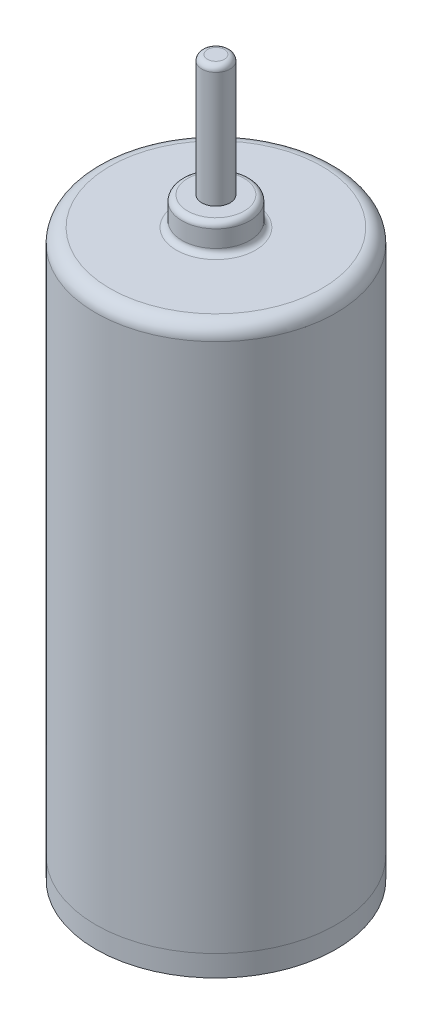
ISO-10303-21;
HEADER;
FILE_DESCRIPTION(('STEP AP214'),'2;1');
FILE_NAME('part.step','',(''),(''),'','','');
FILE_SCHEMA(('AUTOMOTIVE_DESIGN { 1 0 10303 214 1 1 1 1 }'));
ENDSEC;
DATA;
#1=APPLICATION_CONTEXT('core data for automotive mechanical design processes');
#2=APPLICATION_PROTOCOL_DEFINITION('international standard','automotive_design',2000,#1);
#3=PRODUCT_CONTEXT('',#1,'mechanical');
#4=PRODUCT('Part','Part','',(#3));
#5=PRODUCT_RELATED_PRODUCT_CATEGORY('part','',(#4));
#6=PRODUCT_DEFINITION_FORMATION('','',#4);
#7=PRODUCT_DEFINITION_CONTEXT('part definition',#1,'design');
#8=PRODUCT_DEFINITION('design','',#6,#7);
#9=PRODUCT_DEFINITION_SHAPE('','',#8);
#10=(LENGTH_UNIT() NAMED_UNIT(*) SI_UNIT(.MILLI.,.METRE.));
#11=(NAMED_UNIT(*) PLANE_ANGLE_UNIT() SI_UNIT($,.RADIAN.));
#12=(NAMED_UNIT(*) SI_UNIT($,.STERADIAN.) SOLID_ANGLE_UNIT());
#13=UNCERTAINTY_MEASURE_WITH_UNIT(LENGTH_MEASURE(1.E-05),#10,'distance_accuracy_value','');
#14=(GEOMETRIC_REPRESENTATION_CONTEXT(3) GLOBAL_UNCERTAINTY_ASSIGNED_CONTEXT((#13)) GLOBAL_UNIT_ASSIGNED_CONTEXT((#10,
#11,#12)) REPRESENTATION_CONTEXT('',''));
#15=CARTESIAN_POINT('',(0.,0.,0.));
#16=DIRECTION('',(0.,0.,1.));
#17=DIRECTION('',(1.,0.,0.));
#18=AXIS2_PLACEMENT_3D('',#15,#16,#17);
#19=CARTESIAN_POINT('',(0.,52.0208152801713,0.));
#20=DIRECTION('',(0.,-1.,0.));
#21=DIRECTION('',(0.,0.,-1.));
#22=AXIS2_PLACEMENT_3D('',#19,#20,#21);
#23=CYLINDRICAL_SURFACE('',#22,4.25);
#24=CARTESIAN_POINT('',(0.,19.5,0.));
#25=DIRECTION('',(0.,1.,0.));
#26=DIRECTION('',(0.,0.,1.));
#27=AXIS2_PLACEMENT_3D('',#24,#25,#26);
#28=CIRCLE('',#27,4.25);
#29=CARTESIAN_POINT('',(0.,19.5,4.25));
#30=VERTEX_POINT('',#29);
#31=EDGE_CURVE('E67',#30,#30,#28,.F.);
#32=ORIENTED_EDGE('',*,*,#31,.T.);
#33=EDGE_LOOP('',(#32));
#34=FACE_BOUND('',#33,.T.);
#35=CARTESIAN_POINT('',(0.,0.75,0.));
#36=DIRECTION('',(0.,1.,0.));
#37=DIRECTION('',(0.,0.,1.));
#38=AXIS2_PLACEMENT_3D('',#35,#36,#37);
#39=CIRCLE('',#38,4.25);
#40=CARTESIAN_POINT('',(0.,0.75,4.25));
#41=VERTEX_POINT('',#40);
#42=EDGE_CURVE('E73',#41,#41,#39,.T.);
#43=ORIENTED_EDGE('',*,*,#42,.T.);
#44=EDGE_LOOP('',(#43));
#45=FACE_BOUND('',#44,.T.);
#46=ADVANCED_FACE('F41',(#34,#45),#23,.T.);
#47=CARTESIAN_POINT('',(0.,0.75,0.));
#48=DIRECTION('',(0.,1.,0.));
#49=DIRECTION('',(0.,0.,1.));
#50=AXIS2_PLACEMENT_3D('',#47,#48,#49);
#51=PLANE('',#50);
#52=ORIENTED_EDGE('',*,*,#42,.F.);
#53=EDGE_LOOP('',(#52));
#54=FACE_BOUND('',#53,.T.);
#55=ADVANCED_FACE('F97',(#54),#51,.F.);
#56=CARTESIAN_POINT('',(0.,20.,0.));
#57=DIRECTION('',(0.,1.,0.));
#58=DIRECTION('',(0.,0.,1.));
#59=AXIS2_PLACEMENT_3D('',#56,#57,#58);
#60=PLANE('',#59);
#61=CARTESIAN_POINT('',(0.,20.,0.));
#62=DIRECTION('',(0.,1.,0.));
#63=DIRECTION('',(0.,0.,1.));
#64=AXIS2_PLACEMENT_3D('',#61,#62,#63);
#65=CIRCLE('',#64,1.4);
#66=CARTESIAN_POINT('',(0.,20.,1.4));
#67=VERTEX_POINT('',#66);
#68=EDGE_CURVE('E11',#67,#67,#65,.F.);
#69=ORIENTED_EDGE('',*,*,#68,.T.);
#70=EDGE_LOOP('',(#69));
#71=FACE_BOUND('',#70,.T.);
#72=CARTESIAN_POINT('',(0.,20.,0.));
#73=DIRECTION('',(0.,1.,0.));
#74=DIRECTION('',(0.,0.,1.));
#75=AXIS2_PLACEMENT_3D('',#72,#73,#74);
#76=CIRCLE('',#75,3.75);
#77=CARTESIAN_POINT('',(0.,20.,3.75));
#78=VERTEX_POINT('',#77);
#79=EDGE_CURVE('E70',#78,#78,#76,.T.);
#80=ORIENTED_EDGE('',*,*,#79,.T.);
#81=EDGE_LOOP('',(#80));
#82=FACE_BOUND('',#81,.T.);
#83=ADVANCED_FACE('F94',(#71,#82),#60,.T.);
#84=CARTESIAN_POINT('',(0.,21.,0.));
#85=DIRECTION('',(0.,-1.,0.));
#86=DIRECTION('',(0.,0.,-1.));
#87=AXIS2_PLACEMENT_3D('',#84,#85,#86);
#88=CYLINDRICAL_SURFACE('',#87,1.2);
#89=CARTESIAN_POINT('',(0.,20.8,0.));
#90=DIRECTION('',(0.,1.,0.));
#91=DIRECTION('',(0.,0.,1.));
#92=AXIS2_PLACEMENT_3D('',#89,#90,#91);
#93=CIRCLE('',#92,1.2);
#94=CARTESIAN_POINT('',(0.,20.8,1.2));
#95=VERTEX_POINT('',#94);
#96=EDGE_CURVE('E48',#95,#95,#93,.F.);
#97=ORIENTED_EDGE('',*,*,#96,.T.);
#98=EDGE_LOOP('',(#97));
#99=FACE_BOUND('',#98,.T.);
#100=CARTESIAN_POINT('',(0.,20.2,0.));
#101=DIRECTION('',(0.,1.,0.));
#102=DIRECTION('',(0.,0.,1.));
#103=AXIS2_PLACEMENT_3D('',#100,#101,#102);
#104=CIRCLE('',#103,1.2);
#105=CARTESIAN_POINT('',(0.,20.2,1.2));
#106=VERTEX_POINT('',#105);
#107=EDGE_CURVE('E52',#106,#106,#104,.T.);
#108=ORIENTED_EDGE('',*,*,#107,.T.);
#109=EDGE_LOOP('',(#108));
#110=FACE_BOUND('',#109,.T.);
#111=ADVANCED_FACE('F84',(#99,#110),#88,.T.);
#112=CARTESIAN_POINT('',(0.,21.,0.));
#113=DIRECTION('',(0.,1.,0.));
#114=DIRECTION('',(0.,0.,1.));
#115=AXIS2_PLACEMENT_3D('',#112,#113,#114);
#116=PLANE('',#115);
#117=CARTESIAN_POINT('',(0.,21.,0.));
#118=DIRECTION('',(0.,1.,0.));
#119=DIRECTION('',(0.,0.,1.));
#120=AXIS2_PLACEMENT_3D('',#117,#118,#119);
#121=CIRCLE('',#120,1.);
#122=CARTESIAN_POINT('',(0.,21.,1.));
#123=VERTEX_POINT('',#122);
#124=EDGE_CURVE('E56',#123,#123,#121,.T.);
#125=ORIENTED_EDGE('',*,*,#124,.T.);
#126=EDGE_LOOP('',(#125));
#127=FACE_BOUND('',#126,.T.);
#128=CARTESIAN_POINT('',(0.,21.,0.));
#129=DIRECTION('',(0.,1.,0.));
#130=DIRECTION('',(0.,0.,1.));
#131=AXIS2_PLACEMENT_3D('',#128,#129,#130);
#132=CIRCLE('',#131,0.5);
#133=CARTESIAN_POINT('',(0.,21.,0.5));
#134=VERTEX_POINT('',#133);
#135=EDGE_CURVE('E76',#134,#134,#132,.T.);
#136=ORIENTED_EDGE('',*,*,#135,.F.);
#137=EDGE_LOOP('',(#136));
#138=FACE_BOUND('',#137,.T.);
#139=ADVANCED_FACE('F82',(#127,#138),#116,.T.);
#140=CARTESIAN_POINT('',(0.,25.3,0.));
#141=DIRECTION('',(0.,-1.,0.));
#142=DIRECTION('',(0.,0.,-1.));
#143=AXIS2_PLACEMENT_3D('',#140,#141,#142);
#144=CYLINDRICAL_SURFACE('',#143,0.5);
#145=CARTESIAN_POINT('',(0.,25.1,0.));
#146=DIRECTION('',(0.,1.,0.));
#147=DIRECTION('',(0.,0.,1.));
#148=AXIS2_PLACEMENT_3D('',#145,#146,#147);
#149=CIRCLE('',#148,0.5);
#150=CARTESIAN_POINT('',(0.,25.1,0.5));
#151=VERTEX_POINT('',#150);
#152=EDGE_CURVE('E61',#151,#151,#149,.F.);
#153=ORIENTED_EDGE('',*,*,#152,.T.);
#154=EDGE_LOOP('',(#153));
#155=FACE_BOUND('',#154,.T.);
#156=ORIENTED_EDGE('',*,*,#135,.T.);
#157=EDGE_LOOP('',(#156));
#158=FACE_BOUND('',#157,.T.);
#159=ADVANCED_FACE('F80',(#155,#158),#144,.T.);
#160=CARTESIAN_POINT('',(0.,25.3,0.));
#161=DIRECTION('',(0.,1.,0.));
#162=DIRECTION('',(0.,0.,1.));
#163=AXIS2_PLACEMENT_3D('',#160,#161,#162);
#164=PLANE('',#163);
#165=CARTESIAN_POINT('',(0.,25.3,0.));
#166=DIRECTION('',(0.,1.,0.));
#167=DIRECTION('',(0.,0.,1.));
#168=AXIS2_PLACEMENT_3D('',#165,#166,#167);
#169=CIRCLE('',#168,0.3);
#170=CARTESIAN_POINT('',(0.,25.3,0.3));
#171=VERTEX_POINT('',#170);
#172=EDGE_CURVE('E64',#171,#171,#169,.T.);
#173=ORIENTED_EDGE('',*,*,#172,.T.);
#174=EDGE_LOOP('',(#173));
#175=FACE_BOUND('',#174,.T.);
#176=ADVANCED_FACE('F91',(#175),#164,.T.);
#177=CARTESIAN_POINT('',(0.,19.5,0.));
#178=DIRECTION('',(0.,1.,0.));
#179=DIRECTION('',(0.,0.,1.));
#180=AXIS2_PLACEMENT_3D('',#177,#178,#179);
#181=TOROIDAL_SURFACE('',#180,3.75,0.5);
#182=ORIENTED_EDGE('',*,*,#31,.F.);
#183=EDGE_LOOP('',(#182));
#184=FACE_BOUND('',#183,.T.);
#185=ORIENTED_EDGE('',*,*,#79,.F.);
#186=EDGE_LOOP('',(#185));
#187=FACE_BOUND('',#186,.T.);
#188=ADVANCED_FACE('F109',(#184,#187),#181,.T.);
#189=CARTESIAN_POINT('',(0.,25.1,0.));
#190=DIRECTION('',(0.,1.,0.));
#191=DIRECTION('',(0.,0.,1.));
#192=AXIS2_PLACEMENT_3D('',#189,#190,#191);
#193=TOROIDAL_SURFACE('',#192,0.3,0.2);
#194=ORIENTED_EDGE('',*,*,#152,.F.);
#195=EDGE_LOOP('',(#194));
#196=FACE_BOUND('',#195,.T.);
#197=ORIENTED_EDGE('',*,*,#172,.F.);
#198=EDGE_LOOP('',(#197));
#199=FACE_BOUND('',#198,.T.);
#200=ADVANCED_FACE('F112',(#196,#199),#193,.T.);
#201=CARTESIAN_POINT('',(0.,20.8,0.));
#202=DIRECTION('',(0.,1.,0.));
#203=DIRECTION('',(0.,0.,1.));
#204=AXIS2_PLACEMENT_3D('',#201,#202,#203);
#205=TOROIDAL_SURFACE('',#204,1.,0.2);
#206=ORIENTED_EDGE('',*,*,#96,.F.);
#207=EDGE_LOOP('',(#206));
#208=FACE_BOUND('',#207,.T.);
#209=ORIENTED_EDGE('',*,*,#124,.F.);
#210=EDGE_LOOP('',(#209));
#211=FACE_BOUND('',#210,.T.);
#212=ADVANCED_FACE('F115',(#208,#211),#205,.T.);
#213=CARTESIAN_POINT('',(0.,20.2,0.));
#214=DIRECTION('',(0.,1.,0.));
#215=DIRECTION('',(0.,0.,1.));
#216=AXIS2_PLACEMENT_3D('',#213,#214,#215);
#217=TOROIDAL_SURFACE('',#216,1.4,0.2);
#218=ORIENTED_EDGE('',*,*,#68,.F.);
#219=EDGE_LOOP('',(#218));
#220=FACE_BOUND('',#219,.T.);
#221=ORIENTED_EDGE('',*,*,#107,.F.);
#222=EDGE_LOOP('',(#221));
#223=FACE_BOUND('',#222,.T.);
#224=ADVANCED_FACE('F43',(#220,#223),#217,.F.);
#225=CLOSED_SHELL('',(#46,#55,#83,#111,#139,#159,#176,#188,#200,#212,#224));
#226=MANIFOLD_SOLID_BREP('B2',#225);
#227=CARTESIAN_POINT('',(0.,0.75,0.));
#228=DIRECTION('',(0.,-1.,0.));
#229=DIRECTION('',(0.,0.,-1.));
#230=AXIS2_PLACEMENT_3D('',#227,#228,#229);
#231=CYLINDRICAL_SURFACE('',#230,4.25);
#232=CARTESIAN_POINT('',(0.,0.75,0.));
#233=DIRECTION('',(0.,1.,0.));
#234=DIRECTION('',(0.,0.,1.));
#235=AXIS2_PLACEMENT_3D('',#232,#233,#234);
#236=CIRCLE('',#235,4.25);
#237=CARTESIAN_POINT('',(0.,0.75,4.25));
#238=VERTEX_POINT('',#237);
#239=EDGE_CURVE('E216',#238,#238,#236,.T.);
#240=ORIENTED_EDGE('',*,*,#239,.F.);
#241=EDGE_LOOP('',(#240));
#242=FACE_BOUND('',#241,.T.);
#243=CARTESIAN_POINT('',(0.,0.,0.));
#244=DIRECTION('',(0.,1.,0.));
#245=DIRECTION('',(0.,0.,1.));
#246=AXIS2_PLACEMENT_3D('',#243,#244,#245);
#247=CIRCLE('',#246,4.25);
#248=CARTESIAN_POINT('',(0.,0.,4.25));
#249=VERTEX_POINT('',#248);
#250=EDGE_CURVE('E220',#249,#249,#247,.T.);
#251=ORIENTED_EDGE('',*,*,#250,.T.);
#252=EDGE_LOOP('',(#251));
#253=FACE_BOUND('',#252,.T.);
#254=ADVANCED_FACE('F206',(#242,#253),#231,.T.);
#255=CARTESIAN_POINT('',(0.,0.75,0.));
#256=DIRECTION('',(0.,1.,0.));
#257=DIRECTION('',(0.,0.,1.));
#258=AXIS2_PLACEMENT_3D('',#255,#256,#257);
#259=PLANE('',#258);
#260=ORIENTED_EDGE('',*,*,#239,.T.);
#261=EDGE_LOOP('',(#260));
#262=FACE_BOUND('',#261,.T.);
#263=ADVANCED_FACE('F247',(#262),#259,.T.);
#264=CARTESIAN_POINT('',(0.,0.,0.));
#265=DIRECTION('',(0.,1.,0.));
#266=DIRECTION('',(0.,0.,1.));
#267=AXIS2_PLACEMENT_3D('',#264,#265,#266);
#268=PLANE('',#267);
#269=CARTESIAN_POINT('',(2.25,0.,0.));
#270=DIRECTION('',(0.,1.,0.));
#271=DIRECTION('',(0.,0.,1.));
#272=AXIS2_PLACEMENT_3D('',#269,#270,#271);
#273=CIRCLE('',#272,0.35);
#274=CARTESIAN_POINT('',(2.25,0.,0.35));
#275=VERTEX_POINT('',#274);
#276=EDGE_CURVE('E40',#275,#275,#273,.F.);
#277=ORIENTED_EDGE('',*,*,#276,.F.);
#278=EDGE_LOOP('',(#277));
#279=FACE_BOUND('',#278,.T.);
#280=CARTESIAN_POINT('',(-2.25,0.,0.));
#281=DIRECTION('',(0.,1.,0.));
#282=DIRECTION('',(0.,0.,1.));
#283=AXIS2_PLACEMENT_3D('',#280,#281,#282);
#284=CIRCLE('',#283,0.35);
#285=CARTESIAN_POINT('',(-2.25,0.,0.35));
#286=VERTEX_POINT('',#285);
#287=EDGE_CURVE('E212',#286,#286,#284,.F.);
#288=ORIENTED_EDGE('',*,*,#287,.F.);
#289=EDGE_LOOP('',(#288));
#290=FACE_BOUND('',#289,.T.);
#291=ORIENTED_EDGE('',*,*,#250,.F.);
#292=EDGE_LOOP('',(#291));
#293=FACE_BOUND('',#292,.T.);
#294=ADVANCED_FACE('F252',(#279,#290,#293),#268,.F.);
#295=CARTESIAN_POINT('',(-2.25,-0.25,0.));
#296=DIRECTION('',(0.,1.,0.));
#297=DIRECTION('',(0.,0.,1.));
#298=AXIS2_PLACEMENT_3D('',#295,#296,#297);
#299=CYLINDRICAL_SURFACE('',#298,0.35);
#300=CARTESIAN_POINT('',(-2.25,-0.25,0.));
#301=DIRECTION('',(0.,-1.,0.));
#302=DIRECTION('',(0.,0.,-1.));
#303=AXIS2_PLACEMENT_3D('',#300,#301,#302);
#304=CIRCLE('',#303,0.35);
#305=CARTESIAN_POINT('',(-2.25,-0.25,-0.35));
#306=VERTEX_POINT('',#305);
#307=EDGE_CURVE('E224',#306,#306,#304,.T.);
#308=ORIENTED_EDGE('',*,*,#307,.F.);
#309=EDGE_LOOP('',(#308));
#310=FACE_BOUND('',#309,.T.);
#311=ORIENTED_EDGE('',*,*,#287,.T.);
#312=EDGE_LOOP('',(#311));
#313=FACE_BOUND('',#312,.T.);
#314=ADVANCED_FACE('F243',(#310,#313),#299,.T.);
#315=CARTESIAN_POINT('',(-2.25,-0.25,0.));
#316=DIRECTION('',(0.,-1.,0.));
#317=DIRECTION('',(0.,0.,-1.));
#318=AXIS2_PLACEMENT_3D('',#315,#316,#317);
#319=PLANE('',#318);
#320=ORIENTED_EDGE('',*,*,#307,.T.);
#321=EDGE_LOOP('',(#320));
#322=FACE_BOUND('',#321,.T.);
#323=ADVANCED_FACE('F236',(#322),#319,.T.);
#324=CARTESIAN_POINT('',(2.25,-0.25,0.));
#325=DIRECTION('',(0.,1.,0.));
#326=DIRECTION('',(0.,0.,1.));
#327=AXIS2_PLACEMENT_3D('',#324,#325,#326);
#328=CYLINDRICAL_SURFACE('',#327,0.35);
#329=CARTESIAN_POINT('',(2.25,-0.25,0.));
#330=DIRECTION('',(0.,-1.,0.));
#331=DIRECTION('',(0.,0.,-1.));
#332=AXIS2_PLACEMENT_3D('',#329,#330,#331);
#333=CIRCLE('',#332,0.35);
#334=CARTESIAN_POINT('',(2.25,-0.25,-0.35));
#335=VERTEX_POINT('',#334);
#336=EDGE_CURVE('E228',#335,#335,#333,.T.);
#337=ORIENTED_EDGE('',*,*,#336,.F.);
#338=EDGE_LOOP('',(#337));
#339=FACE_BOUND('',#338,.T.);
#340=ORIENTED_EDGE('',*,*,#276,.T.);
#341=EDGE_LOOP('',(#340));
#342=FACE_BOUND('',#341,.T.);
#343=ADVANCED_FACE('F234',(#339,#342),#328,.T.);
#344=CARTESIAN_POINT('',(2.25,-0.25,0.));
#345=DIRECTION('',(0.,-1.,0.));
#346=DIRECTION('',(0.,0.,-1.));
#347=AXIS2_PLACEMENT_3D('',#344,#345,#346);
#348=PLANE('',#347);
#349=ORIENTED_EDGE('',*,*,#336,.T.);
#350=EDGE_LOOP('',(#349));
#351=FACE_BOUND('',#350,.T.);
#352=ADVANCED_FACE('F232',(#351),#348,.T.);
#353=CLOSED_SHELL('',(#254,#263,#294,#314,#323,#343,#352));
#354=MANIFOLD_SOLID_BREP('B6',#353);
#355=ADVANCED_BREP_SHAPE_REPRESENTATION('',(#18,#226,#354),#14);
#356=SHAPE_DEFINITION_REPRESENTATION(#9,#355);
ENDSEC;
END-ISO-10303-21;
